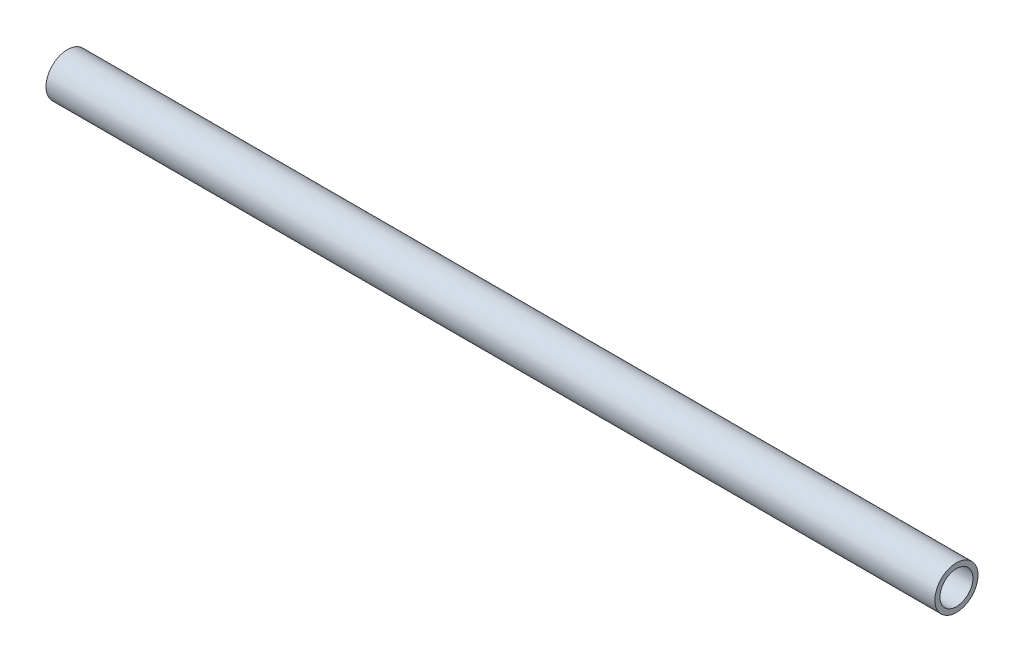
ISO-10303-21;
HEADER;
FILE_DESCRIPTION(('STEP AP214'),'2;1');
FILE_NAME('part.step','',(''),(''),'','','');
FILE_SCHEMA(('AUTOMOTIVE_DESIGN { 1 0 10303 214 1 1 1 1 }'));
ENDSEC;
DATA;
#1=APPLICATION_CONTEXT('core data for automotive mechanical design processes');
#2=APPLICATION_PROTOCOL_DEFINITION('international standard','automotive_design',2000,#1);
#3=PRODUCT_CONTEXT('',#1,'mechanical');
#4=PRODUCT('Part','Part','',(#3));
#5=PRODUCT_RELATED_PRODUCT_CATEGORY('part','',(#4));
#6=PRODUCT_DEFINITION_FORMATION('','',#4);
#7=PRODUCT_DEFINITION_CONTEXT('part definition',#1,'design');
#8=PRODUCT_DEFINITION('design','',#6,#7);
#9=PRODUCT_DEFINITION_SHAPE('','',#8);
#10=(LENGTH_UNIT() NAMED_UNIT(*) SI_UNIT(.MILLI.,.METRE.));
#11=(NAMED_UNIT(*) PLANE_ANGLE_UNIT() SI_UNIT($,.RADIAN.));
#12=(NAMED_UNIT(*) SI_UNIT($,.STERADIAN.) SOLID_ANGLE_UNIT());
#13=UNCERTAINTY_MEASURE_WITH_UNIT(LENGTH_MEASURE(1.E-05),#10,'distance_accuracy_value','');
#14=(GEOMETRIC_REPRESENTATION_CONTEXT(3) GLOBAL_UNCERTAINTY_ASSIGNED_CONTEXT((#13)) GLOBAL_UNIT_ASSIGNED_CONTEXT((#10,
#11,#12)) REPRESENTATION_CONTEXT('',''));
#15=CARTESIAN_POINT('',(0.,0.,0.));
#16=DIRECTION('',(0.,0.,1.));
#17=DIRECTION('',(1.,0.,0.));
#18=AXIS2_PLACEMENT_3D('',#15,#16,#17);
#19=CARTESIAN_POINT('',(330.,0.,0.));
#20=DIRECTION('',(1.,0.,0.));
#21=DIRECTION('',(0.,0.,-1.));
#22=AXIS2_PLACEMENT_3D('',#19,#20,#21);
#23=PLANE('',#22);
#24=CARTESIAN_POINT('',(330.,0.,0.));
#25=DIRECTION('',(1.,0.,0.));
#26=DIRECTION('',(0.,0.,-1.));
#27=AXIS2_PLACEMENT_3D('',#24,#25,#26);
#28=CIRCLE('',#27,8.);
#29=CARTESIAN_POINT('',(330.,0.,-8.));
#30=VERTEX_POINT('',#29);
#31=EDGE_CURVE('E10',#30,#30,#28,.T.);
#32=ORIENTED_EDGE('',*,*,#31,.T.);
#33=EDGE_LOOP('',(#32));
#34=FACE_BOUND('',#33,.T.);
#35=CARTESIAN_POINT('',(330.,0.,0.));
#36=DIRECTION('',(1.,0.,0.));
#37=DIRECTION('',(0.,0.,-1.));
#38=AXIS2_PLACEMENT_3D('',#35,#36,#37);
#39=CIRCLE('',#38,6.1147678504897);
#40=CARTESIAN_POINT('',(330.,0.,-6.1147678504897));
#41=VERTEX_POINT('',#40);
#42=EDGE_CURVE('E54',#41,#41,#39,.T.);
#43=ORIENTED_EDGE('',*,*,#42,.F.);
#44=EDGE_LOOP('',(#43));
#45=FACE_BOUND('',#44,.T.);
#46=ADVANCED_FACE('F41',(#34,#45),#23,.T.);
#47=CARTESIAN_POINT('',(0.,0.,0.));
#48=DIRECTION('',(1.,0.,0.));
#49=DIRECTION('',(0.,0.,-1.));
#50=AXIS2_PLACEMENT_3D('',#47,#48,#49);
#51=PLANE('',#50);
#52=CARTESIAN_POINT('',(0.,0.,0.));
#53=DIRECTION('',(1.,0.,0.));
#54=DIRECTION('',(0.,0.,-1.));
#55=AXIS2_PLACEMENT_3D('',#52,#53,#54);
#56=CIRCLE('',#55,8.);
#57=CARTESIAN_POINT('',(0.,0.,-8.));
#58=VERTEX_POINT('',#57);
#59=EDGE_CURVE('E45',#58,#58,#56,.T.);
#60=ORIENTED_EDGE('',*,*,#59,.F.);
#61=EDGE_LOOP('',(#60));
#62=FACE_BOUND('',#61,.T.);
#63=CARTESIAN_POINT('',(0.,0.,0.));
#64=DIRECTION('',(1.,0.,0.));
#65=DIRECTION('',(0.,0.,-1.));
#66=AXIS2_PLACEMENT_3D('',#63,#64,#65);
#67=CIRCLE('',#66,6.1147678504897);
#68=CARTESIAN_POINT('',(0.,0.,-6.1147678504897));
#69=VERTEX_POINT('',#68);
#70=EDGE_CURVE('E56',#69,#69,#67,.T.);
#71=ORIENTED_EDGE('',*,*,#70,.T.);
#72=EDGE_LOOP('',(#71));
#73=FACE_BOUND('',#72,.T.);
#74=ADVANCED_FACE('F68',(#62,#73),#51,.F.);
#75=CARTESIAN_POINT('',(330.,0.,0.));
#76=DIRECTION('',(-1.,0.,0.));
#77=DIRECTION('',(0.,0.,1.));
#78=AXIS2_PLACEMENT_3D('',#75,#76,#77);
#79=CYLINDRICAL_SURFACE('',#78,8.);
#80=ORIENTED_EDGE('',*,*,#31,.F.);
#81=EDGE_LOOP('',(#80));
#82=FACE_BOUND('',#81,.T.);
#83=ORIENTED_EDGE('',*,*,#59,.T.);
#84=EDGE_LOOP('',(#83));
#85=FACE_BOUND('',#84,.T.);
#86=ADVANCED_FACE('F43',(#82,#85),#79,.T.);
#87=CARTESIAN_POINT('',(330.,0.,0.));
#88=DIRECTION('',(-1.,0.,0.));
#89=DIRECTION('',(0.,0.,1.));
#90=AXIS2_PLACEMENT_3D('',#87,#88,#89);
#91=CYLINDRICAL_SURFACE('',#90,6.1147678504897);
#92=ORIENTED_EDGE('',*,*,#42,.T.);
#93=EDGE_LOOP('',(#92));
#94=FACE_BOUND('',#93,.T.);
#95=ORIENTED_EDGE('',*,*,#70,.F.);
#96=EDGE_LOOP('',(#95));
#97=FACE_BOUND('',#96,.T.);
#98=ADVANCED_FACE('F64',(#94,#97),#91,.F.);
#99=CLOSED_SHELL('',(#46,#74,#86,#98));
#100=MANIFOLD_SOLID_BREP('B2',#99);
#101=ADVANCED_BREP_SHAPE_REPRESENTATION('',(#18,#100),#14);
#102=SHAPE_DEFINITION_REPRESENTATION(#9,#101);
ENDSEC;
END-ISO-10303-21;
